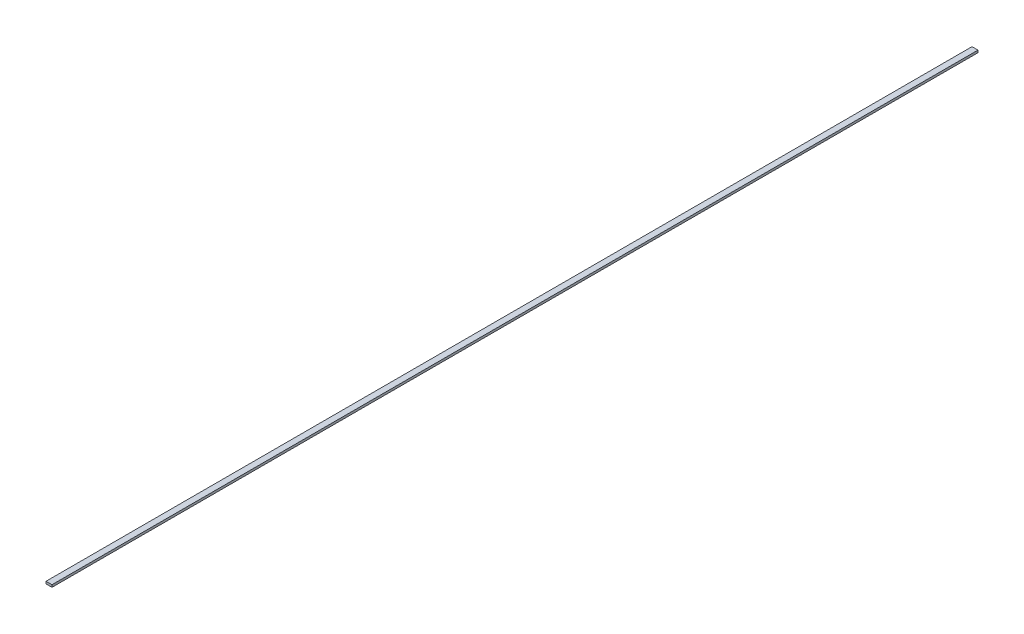
ISO-10303-21;
HEADER;
FILE_DESCRIPTION(('STEP AP214'),'2;1');
FILE_NAME('part.step','',(''),(''),'','','');
FILE_SCHEMA(('AUTOMOTIVE_DESIGN { 1 0 10303 214 1 1 1 1 }'));
ENDSEC;
DATA;
#1=APPLICATION_CONTEXT('core data for automotive mechanical design processes');
#2=APPLICATION_PROTOCOL_DEFINITION('international standard','automotive_design',2000,#1);
#3=PRODUCT_CONTEXT('',#1,'mechanical');
#4=PRODUCT('Part','Part','',(#3));
#5=PRODUCT_RELATED_PRODUCT_CATEGORY('part','',(#4));
#6=PRODUCT_DEFINITION_FORMATION('','',#4);
#7=PRODUCT_DEFINITION_CONTEXT('part definition',#1,'design');
#8=PRODUCT_DEFINITION('design','',#6,#7);
#9=PRODUCT_DEFINITION_SHAPE('','',#8);
#10=(LENGTH_UNIT() NAMED_UNIT(*) SI_UNIT(.MILLI.,.METRE.));
#11=(NAMED_UNIT(*) PLANE_ANGLE_UNIT() SI_UNIT($,.RADIAN.));
#12=(NAMED_UNIT(*) SI_UNIT($,.STERADIAN.) SOLID_ANGLE_UNIT());
#13=UNCERTAINTY_MEASURE_WITH_UNIT(LENGTH_MEASURE(1.E-05),#10,'distance_accuracy_value','');
#14=(GEOMETRIC_REPRESENTATION_CONTEXT(3) GLOBAL_UNCERTAINTY_ASSIGNED_CONTEXT((#13)) GLOBAL_UNIT_ASSIGNED_CONTEXT((#10,
#11,#12)) REPRESENTATION_CONTEXT('',''));
#15=CARTESIAN_POINT('',(0.,0.,0.));
#16=DIRECTION('',(0.,0.,1.));
#17=DIRECTION('',(1.,0.,0.));
#18=AXIS2_PLACEMENT_3D('',#15,#16,#17);
#19=CARTESIAN_POINT('',(-0.0649999999999988,0.05,-10.0925));
#20=DIRECTION('',(1.,0.,0.));
#21=DIRECTION('',(0.,0.,-1.));
#22=AXIS2_PLACEMENT_3D('',#19,#20,#21);
#23=PLANE('',#22);
#24=DIRECTION('',(0.,0.,1.));
#25=VECTOR('',#24,1.);
#26=CARTESIAN_POINT('',(-0.0649999999999988,0.,-10.0925));
#27=LINE('',#26,#25);
#28=CARTESIAN_POINT('',(-0.0649999999999988,0.,-10.0925));
#29=VERTEX_POINT('',#28);
#30=CARTESIAN_POINT('',(-0.0649999999999988,0.,10.0925));
#31=VERTEX_POINT('',#30);
#32=EDGE_CURVE('E98',#29,#31,#27,.T.);
#33=ORIENTED_EDGE('',*,*,#32,.T.);
#34=DIRECTION('',(0.,-1.,0.));
#35=VECTOR('',#34,1.);
#36=CARTESIAN_POINT('',(-0.0649999999999988,0.05,10.0925));
#37=LINE('',#36,#35);
#38=CARTESIAN_POINT('',(-0.0649999999999988,0.05,10.0925));
#39=VERTEX_POINT('',#38);
#40=EDGE_CURVE('E11',#39,#31,#37,.T.);
#41=ORIENTED_EDGE('',*,*,#40,.F.);
#42=DIRECTION('',(0.,0.,1.));
#43=VECTOR('',#42,1.);
#44=CARTESIAN_POINT('',(-0.0649999999999988,0.05,-10.0925));
#45=LINE('',#44,#43);
#46=CARTESIAN_POINT('',(-0.0649999999999988,0.05,-10.0925));
#47=VERTEX_POINT('',#46);
#48=EDGE_CURVE('E86',#47,#39,#45,.T.);
#49=ORIENTED_EDGE('',*,*,#48,.F.);
#50=DIRECTION('',(0.,-1.,0.));
#51=VECTOR('',#50,1.);
#52=CARTESIAN_POINT('',(-0.0649999999999988,0.05,-10.0925));
#53=LINE('',#52,#51);
#54=EDGE_CURVE('E94',#47,#29,#53,.T.);
#55=ORIENTED_EDGE('',*,*,#54,.T.);
#56=EDGE_LOOP('',(#33,#41,#49,#55));
#57=FACE_BOUND('',#56,.T.);
#58=ADVANCED_FACE('F35',(#57),#23,.F.);
#59=CARTESIAN_POINT('',(-0.0649999999999988,0.05,10.0925));
#60=DIRECTION('',(0.,0.,-1.));
#61=DIRECTION('',(-1.,0.,0.));
#62=AXIS2_PLACEMENT_3D('',#59,#60,#61);
#63=PLANE('',#62);
#64=DIRECTION('',(1.,0.,0.));
#65=VECTOR('',#64,1.);
#66=CARTESIAN_POINT('',(-0.0649999999999988,0.,10.0925));
#67=LINE('',#66,#65);
#68=CARTESIAN_POINT('',(0.0650000000000013,0.,10.0925));
#69=VERTEX_POINT('',#68);
#70=EDGE_CURVE('E90',#31,#69,#67,.T.);
#71=ORIENTED_EDGE('',*,*,#70,.T.);
#72=DIRECTION('',(0.,-1.,0.));
#73=VECTOR('',#72,1.);
#74=CARTESIAN_POINT('',(0.0650000000000013,0.05,10.0925));
#75=LINE('',#74,#73);
#76=CARTESIAN_POINT('',(0.0650000000000013,0.05,10.0925));
#77=VERTEX_POINT('',#76);
#78=EDGE_CURVE('E43',#77,#69,#75,.T.);
#79=ORIENTED_EDGE('',*,*,#78,.F.);
#80=DIRECTION('',(1.,0.,0.));
#81=VECTOR('',#80,1.);
#82=CARTESIAN_POINT('',(-0.0649999999999988,0.05,10.0925));
#83=LINE('',#82,#81);
#84=EDGE_CURVE('E81',#39,#77,#83,.T.);
#85=ORIENTED_EDGE('',*,*,#84,.F.);
#86=ORIENTED_EDGE('',*,*,#40,.T.);
#87=EDGE_LOOP('',(#71,#79,#85,#86));
#88=FACE_BOUND('',#87,.T.);
#89=ADVANCED_FACE('F89',(#88),#63,.F.);
#90=CARTESIAN_POINT('',(0.0650000000000012,0.05,-10.0925));
#91=DIRECTION('',(-1.,0.,0.));
#92=DIRECTION('',(0.,0.,1.));
#93=AXIS2_PLACEMENT_3D('',#90,#91,#92);
#94=PLANE('',#93);
#95=DIRECTION('',(0.,0.,-1.));
#96=VECTOR('',#95,1.);
#97=CARTESIAN_POINT('',(0.0650000000000012,0.,-10.0925));
#98=LINE('',#97,#96);
#99=CARTESIAN_POINT('',(0.0650000000000012,0.,-10.0925));
#100=VERTEX_POINT('',#99);
#101=EDGE_CURVE('E68',#69,#100,#98,.T.);
#102=ORIENTED_EDGE('',*,*,#101,.T.);
#103=DIRECTION('',(0.,-1.,0.));
#104=VECTOR('',#103,1.);
#105=CARTESIAN_POINT('',(0.0650000000000012,0.05,-10.0925));
#106=LINE('',#105,#104);
#107=CARTESIAN_POINT('',(0.0650000000000012,0.05,-10.0925));
#108=VERTEX_POINT('',#107);
#109=EDGE_CURVE('E91',#108,#100,#106,.T.);
#110=ORIENTED_EDGE('',*,*,#109,.F.);
#111=DIRECTION('',(0.,0.,-1.));
#112=VECTOR('',#111,1.);
#113=CARTESIAN_POINT('',(0.0650000000000012,0.05,-10.0925));
#114=LINE('',#113,#112);
#115=EDGE_CURVE('E84',#77,#108,#114,.T.);
#116=ORIENTED_EDGE('',*,*,#115,.F.);
#117=ORIENTED_EDGE('',*,*,#78,.T.);
#118=EDGE_LOOP('',(#102,#110,#116,#117));
#119=FACE_BOUND('',#118,.T.);
#120=ADVANCED_FACE('F92',(#119),#94,.F.);
#121=CARTESIAN_POINT('',(-0.0649999999999988,0.05,-10.0925));
#122=DIRECTION('',(0.,0.,1.));
#123=DIRECTION('',(1.,0.,0.));
#124=AXIS2_PLACEMENT_3D('',#121,#122,#123);
#125=PLANE('',#124);
#126=DIRECTION('',(-1.,0.,0.));
#127=VECTOR('',#126,1.);
#128=CARTESIAN_POINT('',(-0.0649999999999988,0.,-10.0925));
#129=LINE('',#128,#127);
#130=EDGE_CURVE('E74',#100,#29,#129,.T.);
#131=ORIENTED_EDGE('',*,*,#130,.T.);
#132=ORIENTED_EDGE('',*,*,#54,.F.);
#133=DIRECTION('',(-1.,0.,0.));
#134=VECTOR('',#133,1.);
#135=CARTESIAN_POINT('',(-0.0649999999999988,0.05,-10.0925));
#136=LINE('',#135,#134);
#137=EDGE_CURVE('E51',#108,#47,#136,.T.);
#138=ORIENTED_EDGE('',*,*,#137,.F.);
#139=ORIENTED_EDGE('',*,*,#109,.T.);
#140=EDGE_LOOP('',(#131,#132,#138,#139));
#141=FACE_BOUND('',#140,.T.);
#142=ADVANCED_FACE('F105',(#141),#125,.F.);
#143=CARTESIAN_POINT('',(-0.0649999999999988,0.05,10.0925));
#144=DIRECTION('',(0.,1.,0.));
#145=DIRECTION('',(0.,0.,1.));
#146=AXIS2_PLACEMENT_3D('',#143,#144,#145);
#147=PLANE('',#146);
#148=ORIENTED_EDGE('',*,*,#48,.T.);
#149=ORIENTED_EDGE('',*,*,#84,.T.);
#150=ORIENTED_EDGE('',*,*,#115,.T.);
#151=ORIENTED_EDGE('',*,*,#137,.T.);
#152=EDGE_LOOP('',(#148,#149,#150,#151));
#153=FACE_BOUND('',#152,.T.);
#154=ADVANCED_FACE('F82',(#153),#147,.T.);
#155=CARTESIAN_POINT('',(-0.0649999999999988,0.,10.0925));
#156=DIRECTION('',(0.,1.,0.));
#157=DIRECTION('',(0.,0.,1.));
#158=AXIS2_PLACEMENT_3D('',#155,#156,#157);
#159=PLANE('',#158);
#160=ORIENTED_EDGE('',*,*,#32,.F.);
#161=ORIENTED_EDGE('',*,*,#130,.F.);
#162=ORIENTED_EDGE('',*,*,#101,.F.);
#163=ORIENTED_EDGE('',*,*,#70,.F.);
#164=EDGE_LOOP('',(#160,#161,#162,#163));
#165=FACE_BOUND('',#164,.T.);
#166=ADVANCED_FACE('F108',(#165),#159,.F.);
#167=CLOSED_SHELL('',(#58,#89,#120,#142,#154,#166));
#168=MANIFOLD_SOLID_BREP('B2',#167);
#169=ADVANCED_BREP_SHAPE_REPRESENTATION('',(#18,#168),#14);
#170=SHAPE_DEFINITION_REPRESENTATION(#9,#169);
ENDSEC;
END-ISO-10303-21;
